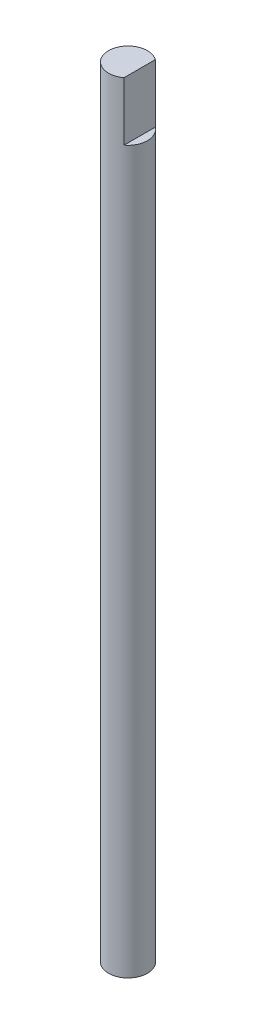
ISO-10303-21;
HEADER;
FILE_DESCRIPTION(('STEP AP214'),'2;1');
FILE_NAME('part.step','',(''),(''),'','','');
FILE_SCHEMA(('AUTOMOTIVE_DESIGN { 1 0 10303 214 1 1 1 1 }'));
ENDSEC;
DATA;
#1=APPLICATION_CONTEXT('core data for automotive mechanical design processes');
#2=APPLICATION_PROTOCOL_DEFINITION('international standard','automotive_design',2000,#1);
#3=PRODUCT_CONTEXT('',#1,'mechanical');
#4=PRODUCT('Part','Part','',(#3));
#5=PRODUCT_RELATED_PRODUCT_CATEGORY('part','',(#4));
#6=PRODUCT_DEFINITION_FORMATION('','',#4);
#7=PRODUCT_DEFINITION_CONTEXT('part definition',#1,'design');
#8=PRODUCT_DEFINITION('design','',#6,#7);
#9=PRODUCT_DEFINITION_SHAPE('','',#8);
#10=(LENGTH_UNIT() NAMED_UNIT(*) SI_UNIT(.MILLI.,.METRE.));
#11=(NAMED_UNIT(*) PLANE_ANGLE_UNIT() SI_UNIT($,.RADIAN.));
#12=(NAMED_UNIT(*) SI_UNIT($,.STERADIAN.) SOLID_ANGLE_UNIT());
#13=UNCERTAINTY_MEASURE_WITH_UNIT(LENGTH_MEASURE(1.E-05),#10,'distance_accuracy_value','');
#14=(GEOMETRIC_REPRESENTATION_CONTEXT(3) GLOBAL_UNCERTAINTY_ASSIGNED_CONTEXT((#13)) GLOBAL_UNIT_ASSIGNED_CONTEXT((#10,
#11,#12)) REPRESENTATION_CONTEXT('',''));
#15=CARTESIAN_POINT('',(0.,0.,0.));
#16=DIRECTION('',(0.,0.,1.));
#17=DIRECTION('',(1.,0.,0.));
#18=AXIS2_PLACEMENT_3D('',#15,#16,#17);
#19=CARTESIAN_POINT('',(0.,200.,0.));
#20=DIRECTION('',(0.,-1.,0.));
#21=DIRECTION('',(0.,0.,-1.));
#22=AXIS2_PLACEMENT_3D('',#19,#20,#21);
#23=CYLINDRICAL_SURFACE('',#22,5.);
#24=CARTESIAN_POINT('',(0.,200.,0.));
#25=DIRECTION('',(0.,1.,0.));
#26=DIRECTION('',(0.,0.,1.));
#27=AXIS2_PLACEMENT_3D('',#24,#25,#26);
#28=CIRCLE('',#27,5.);
#29=CARTESIAN_POINT('',(3.,200.,-4.));
#30=VERTEX_POINT('',#29);
#31=CARTESIAN_POINT('',(3.,200.,4.));
#32=VERTEX_POINT('',#31);
#33=EDGE_CURVE('E68',#30,#32,#28,.T.);
#34=ORIENTED_EDGE('',*,*,#33,.F.);
#35=DIRECTION('',(0.,-1.,0.));
#36=VECTOR('',#35,1.);
#37=CARTESIAN_POINT('',(3.,200.,-4.));
#38=LINE('',#37,#36);
#39=CARTESIAN_POINT('',(3.,185.,-4.));
#40=VERTEX_POINT('',#39);
#41=EDGE_CURVE('E48',#30,#40,#38,.T.);
#42=ORIENTED_EDGE('',*,*,#41,.T.);
#43=CARTESIAN_POINT('',(0.,185.,0.));
#44=DIRECTION('',(0.,-1.,0.));
#45=DIRECTION('',(0.,0.,-1.));
#46=AXIS2_PLACEMENT_3D('',#43,#44,#45);
#47=CIRCLE('',#46,5.);
#48=CARTESIAN_POINT('',(3.,185.,4.));
#49=VERTEX_POINT('',#48);
#50=EDGE_CURVE('E11',#40,#49,#47,.T.);
#51=ORIENTED_EDGE('',*,*,#50,.T.);
#52=DIRECTION('',(0.,-1.,0.));
#53=VECTOR('',#52,1.);
#54=CARTESIAN_POINT('',(3.,200.,4.));
#55=LINE('',#54,#53);
#56=EDGE_CURVE('E63',#49,#32,#55,.F.);
#57=ORIENTED_EDGE('',*,*,#56,.T.);
#58=EDGE_LOOP('',(#34,#42,#51,#57));
#59=FACE_BOUND('',#58,.T.);
#60=CARTESIAN_POINT('',(0.,0.,0.));
#61=DIRECTION('',(0.,1.,0.));
#62=DIRECTION('',(0.,0.,1.));
#63=AXIS2_PLACEMENT_3D('',#60,#61,#62);
#64=CIRCLE('',#63,5.);
#65=CARTESIAN_POINT('',(0.,0.,5.));
#66=VERTEX_POINT('',#65);
#67=EDGE_CURVE('E69',#66,#66,#64,.T.);
#68=ORIENTED_EDGE('',*,*,#67,.T.);
#69=EDGE_LOOP('',(#68));
#70=FACE_BOUND('',#69,.T.);
#71=ADVANCED_FACE('F34',(#59,#70),#23,.T.);
#72=CARTESIAN_POINT('',(0.,200.,0.));
#73=DIRECTION('',(0.,1.,0.));
#74=DIRECTION('',(0.,0.,1.));
#75=AXIS2_PLACEMENT_3D('',#72,#73,#74);
#76=PLANE('',#75);
#77=DIRECTION('',(0.,0.,1.));
#78=VECTOR('',#77,1.);
#79=CARTESIAN_POINT('',(3.,200.,0.));
#80=LINE('',#79,#78);
#81=EDGE_CURVE('E41',#30,#32,#80,.T.);
#82=ORIENTED_EDGE('',*,*,#81,.F.);
#83=ORIENTED_EDGE('',*,*,#33,.T.);
#84=EDGE_LOOP('',(#82,#83));
#85=FACE_BOUND('',#84,.T.);
#86=ADVANCED_FACE('F76',(#85),#76,.T.);
#87=CARTESIAN_POINT('',(0.,0.,0.));
#88=DIRECTION('',(0.,1.,0.));
#89=DIRECTION('',(0.,0.,1.));
#90=AXIS2_PLACEMENT_3D('',#87,#88,#89);
#91=PLANE('',#90);
#92=ORIENTED_EDGE('',*,*,#67,.F.);
#93=EDGE_LOOP('',(#92));
#94=FACE_BOUND('',#93,.T.);
#95=ADVANCED_FACE('F78',(#94),#91,.F.);
#96=CARTESIAN_POINT('',(3.,185.,-5.));
#97=DIRECTION('',(0.,-1.,0.));
#98=DIRECTION('',(0.,0.,-1.));
#99=AXIS2_PLACEMENT_3D('',#96,#97,#98);
#100=PLANE('',#99);
#101=DIRECTION('',(0.,0.,1.));
#102=VECTOR('',#101,1.);
#103=CARTESIAN_POINT('',(3.,185.,-5.));
#104=LINE('',#103,#102);
#105=EDGE_CURVE('E60',#40,#49,#104,.T.);
#106=ORIENTED_EDGE('',*,*,#105,.T.);
#107=ORIENTED_EDGE('',*,*,#50,.F.);
#108=EDGE_LOOP('',(#106,#107));
#109=FACE_BOUND('',#108,.T.);
#110=ADVANCED_FACE('F59',(#109),#100,.F.);
#111=CARTESIAN_POINT('',(3.,201.134958609329,-5.));
#112=DIRECTION('',(-1.,0.,0.));
#113=DIRECTION('',(0.,-1.,0.));
#114=AXIS2_PLACEMENT_3D('',#111,#112,#113);
#115=PLANE('',#114);
#116=ORIENTED_EDGE('',*,*,#81,.T.);
#117=ORIENTED_EDGE('',*,*,#56,.F.);
#118=ORIENTED_EDGE('',*,*,#105,.F.);
#119=ORIENTED_EDGE('',*,*,#41,.F.);
#120=EDGE_LOOP('',(#116,#117,#118,#119));
#121=FACE_BOUND('',#120,.T.);
#122=ADVANCED_FACE('F62',(#121),#115,.F.);
#123=CLOSED_SHELL('',(#71,#86,#95,#110,#122));
#124=MANIFOLD_SOLID_BREP('B2',#123);
#125=ADVANCED_BREP_SHAPE_REPRESENTATION('',(#18,#124),#14);
#126=SHAPE_DEFINITION_REPRESENTATION(#9,#125);
ENDSEC;
END-ISO-10303-21;
